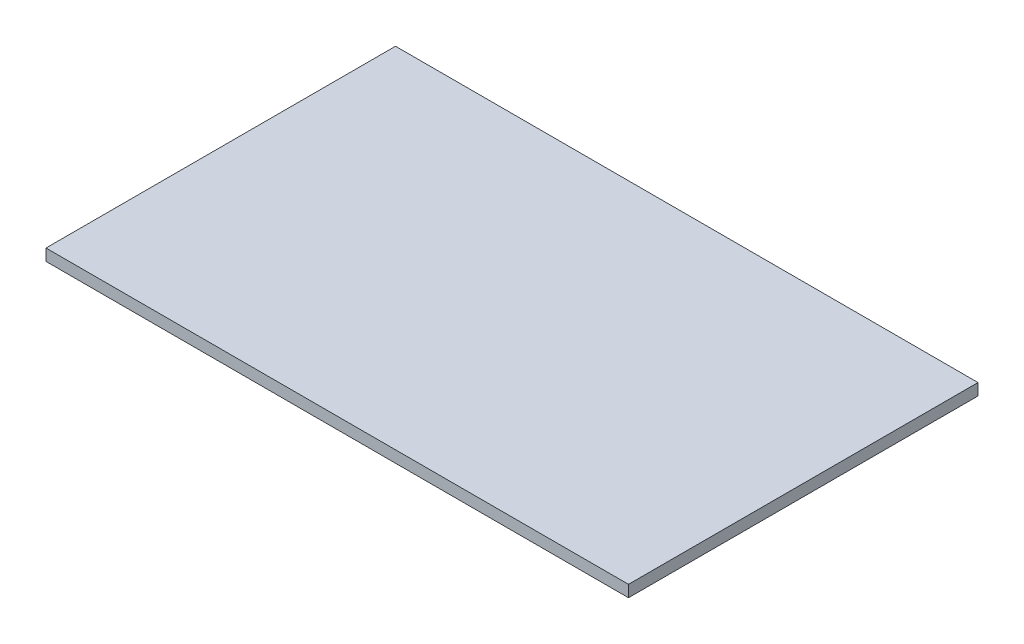
ISO-10303-21;
HEADER;
FILE_DESCRIPTION(('STEP AP214'),'2;1');
FILE_NAME('part.step','',(''),(''),'','','');
FILE_SCHEMA(('AUTOMOTIVE_DESIGN { 1 0 10303 214 1 1 1 1 }'));
ENDSEC;
DATA;
#1=APPLICATION_CONTEXT('core data for automotive mechanical design processes');
#2=APPLICATION_PROTOCOL_DEFINITION('international standard','automotive_design',2000,#1);
#3=PRODUCT_CONTEXT('',#1,'mechanical');
#4=PRODUCT('Part','Part','',(#3));
#5=PRODUCT_RELATED_PRODUCT_CATEGORY('part','',(#4));
#6=PRODUCT_DEFINITION_FORMATION('','',#4);
#7=PRODUCT_DEFINITION_CONTEXT('part definition',#1,'design');
#8=PRODUCT_DEFINITION('design','',#6,#7);
#9=PRODUCT_DEFINITION_SHAPE('','',#8);
#10=(LENGTH_UNIT() NAMED_UNIT(*) SI_UNIT(.MILLI.,.METRE.));
#11=(NAMED_UNIT(*) PLANE_ANGLE_UNIT() SI_UNIT($,.RADIAN.));
#12=(NAMED_UNIT(*) SI_UNIT($,.STERADIAN.) SOLID_ANGLE_UNIT());
#13=UNCERTAINTY_MEASURE_WITH_UNIT(LENGTH_MEASURE(1.E-05),#10,'distance_accuracy_value','');
#14=(GEOMETRIC_REPRESENTATION_CONTEXT(3) GLOBAL_UNCERTAINTY_ASSIGNED_CONTEXT((#13)) GLOBAL_UNIT_ASSIGNED_CONTEXT((#10,
#11,#12)) REPRESENTATION_CONTEXT('',''));
#15=CARTESIAN_POINT('',(0.,0.,0.));
#16=DIRECTION('',(0.,0.,1.));
#17=DIRECTION('',(1.,0.,0.));
#18=AXIS2_PLACEMENT_3D('',#15,#16,#17);
#19=CARTESIAN_POINT('',(0.,6.,0.));
#20=DIRECTION('',(1.,0.,0.));
#21=DIRECTION('',(0.,0.,-1.));
#22=AXIS2_PLACEMENT_3D('',#19,#20,#21);
#23=PLANE('',#22);
#24=DIRECTION('',(0.,0.,1.));
#25=VECTOR('',#24,1.);
#26=CARTESIAN_POINT('',(0.,0.,0.));
#27=LINE('',#26,#25);
#28=CARTESIAN_POINT('',(0.,0.,-180.));
#29=VERTEX_POINT('',#28);
#30=CARTESIAN_POINT('',(0.,0.,0.));
#31=VERTEX_POINT('',#30);
#32=EDGE_CURVE('E99',#29,#31,#27,.T.);
#33=ORIENTED_EDGE('',*,*,#32,.T.);
#34=DIRECTION('',(0.,-1.,0.));
#35=VECTOR('',#34,1.);
#36=CARTESIAN_POINT('',(0.,6.,0.));
#37=LINE('',#36,#35);
#38=CARTESIAN_POINT('',(0.,6.,0.));
#39=VERTEX_POINT('',#38);
#40=EDGE_CURVE('E11',#39,#31,#37,.T.);
#41=ORIENTED_EDGE('',*,*,#40,.F.);
#42=DIRECTION('',(0.,0.,1.));
#43=VECTOR('',#42,1.);
#44=CARTESIAN_POINT('',(0.,6.,0.));
#45=LINE('',#44,#43);
#46=CARTESIAN_POINT('',(0.,6.,-180.));
#47=VERTEX_POINT('',#46);
#48=EDGE_CURVE('E87',#47,#39,#45,.T.);
#49=ORIENTED_EDGE('',*,*,#48,.F.);
#50=DIRECTION('',(0.,-1.,0.));
#51=VECTOR('',#50,1.);
#52=CARTESIAN_POINT('',(0.,6.,-180.));
#53=LINE('',#52,#51);
#54=EDGE_CURVE('E95',#47,#29,#53,.T.);
#55=ORIENTED_EDGE('',*,*,#54,.T.);
#56=EDGE_LOOP('',(#33,#41,#49,#55));
#57=FACE_BOUND('',#56,.T.);
#58=ADVANCED_FACE('F36',(#57),#23,.F.);
#59=CARTESIAN_POINT('',(0.,6.,0.));
#60=DIRECTION('',(0.,0.,-1.));
#61=DIRECTION('',(-1.,0.,0.));
#62=AXIS2_PLACEMENT_3D('',#59,#60,#61);
#63=PLANE('',#62);
#64=DIRECTION('',(1.,0.,0.));
#65=VECTOR('',#64,1.);
#66=CARTESIAN_POINT('',(0.,0.,0.));
#67=LINE('',#66,#65);
#68=CARTESIAN_POINT('',(300.,0.,0.));
#69=VERTEX_POINT('',#68);
#70=EDGE_CURVE('E91',#31,#69,#67,.T.);
#71=ORIENTED_EDGE('',*,*,#70,.T.);
#72=DIRECTION('',(0.,-1.,0.));
#73=VECTOR('',#72,1.);
#74=CARTESIAN_POINT('',(300.,6.,0.));
#75=LINE('',#74,#73);
#76=CARTESIAN_POINT('',(300.,6.,0.));
#77=VERTEX_POINT('',#76);
#78=EDGE_CURVE('E44',#77,#69,#75,.T.);
#79=ORIENTED_EDGE('',*,*,#78,.F.);
#80=DIRECTION('',(1.,0.,0.));
#81=VECTOR('',#80,1.);
#82=CARTESIAN_POINT('',(0.,6.,0.));
#83=LINE('',#82,#81);
#84=EDGE_CURVE('E82',#39,#77,#83,.T.);
#85=ORIENTED_EDGE('',*,*,#84,.F.);
#86=ORIENTED_EDGE('',*,*,#40,.T.);
#87=EDGE_LOOP('',(#71,#79,#85,#86));
#88=FACE_BOUND('',#87,.T.);
#89=ADVANCED_FACE('F90',(#88),#63,.F.);
#90=CARTESIAN_POINT('',(300.,6.,0.));
#91=DIRECTION('',(-1.,0.,0.));
#92=DIRECTION('',(0.,0.,1.));
#93=AXIS2_PLACEMENT_3D('',#90,#91,#92);
#94=PLANE('',#93);
#95=DIRECTION('',(0.,0.,-1.));
#96=VECTOR('',#95,1.);
#97=CARTESIAN_POINT('',(300.,0.,0.));
#98=LINE('',#97,#96);
#99=CARTESIAN_POINT('',(300.,0.,-180.));
#100=VERTEX_POINT('',#99);
#101=EDGE_CURVE('E69',#69,#100,#98,.T.);
#102=ORIENTED_EDGE('',*,*,#101,.T.);
#103=DIRECTION('',(0.,-1.,0.));
#104=VECTOR('',#103,1.);
#105=CARTESIAN_POINT('',(300.,6.,-180.));
#106=LINE('',#105,#104);
#107=CARTESIAN_POINT('',(300.,6.,-180.));
#108=VERTEX_POINT('',#107);
#109=EDGE_CURVE('E92',#108,#100,#106,.T.);
#110=ORIENTED_EDGE('',*,*,#109,.F.);
#111=DIRECTION('',(0.,0.,-1.));
#112=VECTOR('',#111,1.);
#113=CARTESIAN_POINT('',(300.,6.,0.));
#114=LINE('',#113,#112);
#115=EDGE_CURVE('E85',#77,#108,#114,.T.);
#116=ORIENTED_EDGE('',*,*,#115,.F.);
#117=ORIENTED_EDGE('',*,*,#78,.T.);
#118=EDGE_LOOP('',(#102,#110,#116,#117));
#119=FACE_BOUND('',#118,.T.);
#120=ADVANCED_FACE('F93',(#119),#94,.F.);
#121=CARTESIAN_POINT('',(0.,6.,-180.));
#122=DIRECTION('',(0.,0.,1.));
#123=DIRECTION('',(1.,0.,0.));
#124=AXIS2_PLACEMENT_3D('',#121,#122,#123);
#125=PLANE('',#124);
#126=DIRECTION('',(-1.,0.,0.));
#127=VECTOR('',#126,1.);
#128=CARTESIAN_POINT('',(0.,0.,-180.));
#129=LINE('',#128,#127);
#130=EDGE_CURVE('E75',#100,#29,#129,.T.);
#131=ORIENTED_EDGE('',*,*,#130,.T.);
#132=ORIENTED_EDGE('',*,*,#54,.F.);
#133=DIRECTION('',(-1.,0.,0.));
#134=VECTOR('',#133,1.);
#135=CARTESIAN_POINT('',(0.,6.,-180.));
#136=LINE('',#135,#134);
#137=EDGE_CURVE('E52',#108,#47,#136,.T.);
#138=ORIENTED_EDGE('',*,*,#137,.F.);
#139=ORIENTED_EDGE('',*,*,#109,.T.);
#140=EDGE_LOOP('',(#131,#132,#138,#139));
#141=FACE_BOUND('',#140,.T.);
#142=ADVANCED_FACE('F106',(#141),#125,.F.);
#143=CARTESIAN_POINT('',(0.,6.,0.));
#144=DIRECTION('',(0.,-1.,0.));
#145=DIRECTION('',(0.,0.,-1.));
#146=AXIS2_PLACEMENT_3D('',#143,#144,#145);
#147=PLANE('',#146);
#148=ORIENTED_EDGE('',*,*,#48,.T.);
#149=ORIENTED_EDGE('',*,*,#84,.T.);
#150=ORIENTED_EDGE('',*,*,#115,.T.);
#151=ORIENTED_EDGE('',*,*,#137,.T.);
#152=EDGE_LOOP('',(#148,#149,#150,#151));
#153=FACE_BOUND('',#152,.T.);
#154=ADVANCED_FACE('F83',(#153),#147,.F.);
#155=CARTESIAN_POINT('',(0.,0.,0.));
#156=DIRECTION('',(0.,-1.,0.));
#157=DIRECTION('',(0.,0.,-1.));
#158=AXIS2_PLACEMENT_3D('',#155,#156,#157);
#159=PLANE('',#158);
#160=ORIENTED_EDGE('',*,*,#32,.F.);
#161=ORIENTED_EDGE('',*,*,#130,.F.);
#162=ORIENTED_EDGE('',*,*,#101,.F.);
#163=ORIENTED_EDGE('',*,*,#70,.F.);
#164=EDGE_LOOP('',(#160,#161,#162,#163));
#165=FACE_BOUND('',#164,.T.);
#166=ADVANCED_FACE('F109',(#165),#159,.T.);
#167=CLOSED_SHELL('',(#58,#89,#120,#142,#154,#166));
#168=MANIFOLD_SOLID_BREP('B2',#167);
#169=ADVANCED_BREP_SHAPE_REPRESENTATION('',(#18,#168),#14);
#170=SHAPE_DEFINITION_REPRESENTATION(#9,#169);
ENDSEC;
END-ISO-10303-21;
